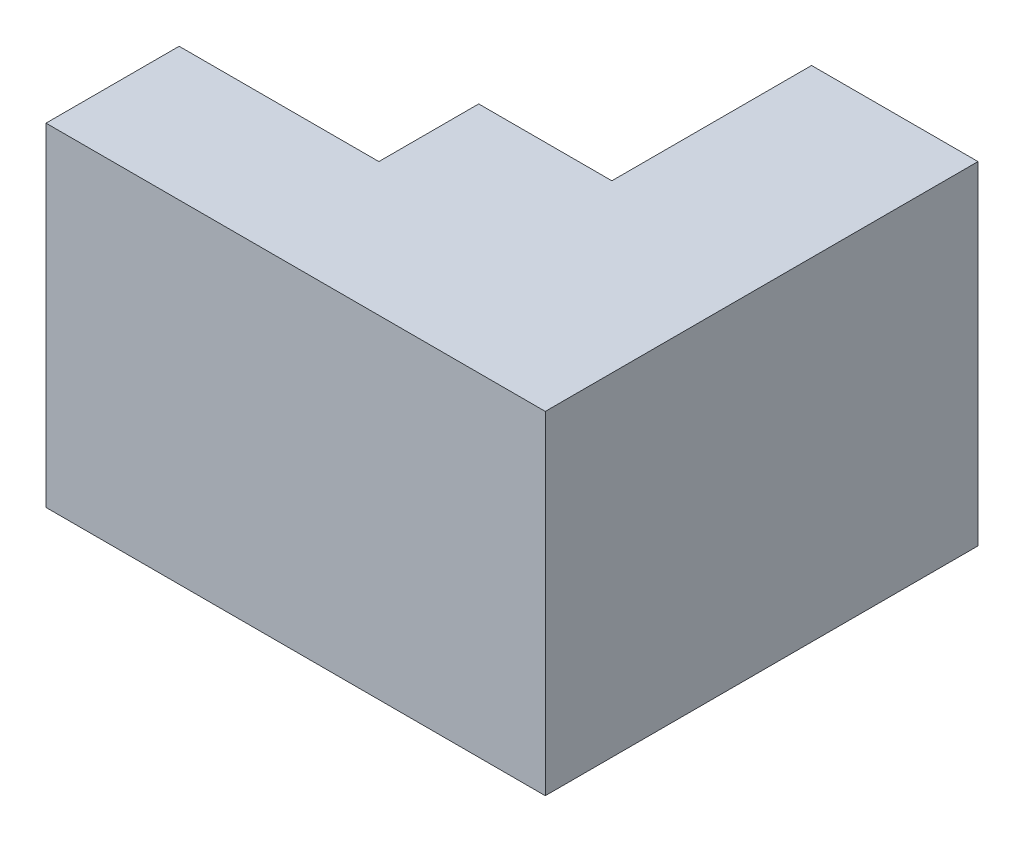
ISO-10303-21;
HEADER;
FILE_DESCRIPTION(('STEP AP214'),'2;1');
FILE_NAME('part.step','',(''),(''),'','','');
FILE_SCHEMA(('AUTOMOTIVE_DESIGN { 1 0 10303 214 1 1 1 1 }'));
ENDSEC;
DATA;
#1=APPLICATION_CONTEXT('core data for automotive mechanical design processes');
#2=APPLICATION_PROTOCOL_DEFINITION('international standard','automotive_design',2000,#1);
#3=PRODUCT_CONTEXT('',#1,'mechanical');
#4=PRODUCT('Part','Part','',(#3));
#5=PRODUCT_RELATED_PRODUCT_CATEGORY('part','',(#4));
#6=PRODUCT_DEFINITION_FORMATION('','',#4);
#7=PRODUCT_DEFINITION_CONTEXT('part definition',#1,'design');
#8=PRODUCT_DEFINITION('design','',#6,#7);
#9=PRODUCT_DEFINITION_SHAPE('','',#8);
#10=(LENGTH_UNIT() NAMED_UNIT(*) SI_UNIT(.MILLI.,.METRE.));
#11=(NAMED_UNIT(*) PLANE_ANGLE_UNIT() SI_UNIT($,.RADIAN.));
#12=(NAMED_UNIT(*) SI_UNIT($,.STERADIAN.) SOLID_ANGLE_UNIT());
#13=UNCERTAINTY_MEASURE_WITH_UNIT(LENGTH_MEASURE(1.E-05),#10,'distance_accuracy_value','');
#14=(GEOMETRIC_REPRESENTATION_CONTEXT(3) GLOBAL_UNCERTAINTY_ASSIGNED_CONTEXT((#13)) GLOBAL_UNIT_ASSIGNED_CONTEXT((#10,
#11,#12)) REPRESENTATION_CONTEXT('',''));
#15=CARTESIAN_POINT('',(0.,0.,0.));
#16=DIRECTION('',(0.,0.,1.));
#17=DIRECTION('',(1.,0.,0.));
#18=AXIS2_PLACEMENT_3D('',#15,#16,#17);
#19=CARTESIAN_POINT('',(0.,50.,-20.));
#20=DIRECTION('',(1.,0.,0.));
#21=DIRECTION('',(0.,0.,-1.));
#22=AXIS2_PLACEMENT_3D('',#19,#20,#21);
#23=PLANE('',#22);
#24=DIRECTION('',(0.,0.,1.));
#25=VECTOR('',#24,1.);
#26=CARTESIAN_POINT('',(0.,0.,-20.));
#27=LINE('',#26,#25);
#28=CARTESIAN_POINT('',(0.,0.,-20.));
#29=VERTEX_POINT('',#28);
#30=CARTESIAN_POINT('',(0.,0.,0.));
#31=VERTEX_POINT('',#30);
#32=EDGE_CURVE('E140',#29,#31,#27,.T.);
#33=ORIENTED_EDGE('',*,*,#32,.T.);
#34=DIRECTION('',(0.,-1.,0.));
#35=VECTOR('',#34,1.);
#36=CARTESIAN_POINT('',(0.,50.,0.));
#37=LINE('',#36,#35);
#38=CARTESIAN_POINT('',(0.,50.,0.));
#39=VERTEX_POINT('',#38);
#40=EDGE_CURVE('E11',#39,#31,#37,.T.);
#41=ORIENTED_EDGE('',*,*,#40,.F.);
#42=DIRECTION('',(0.,0.,1.));
#43=VECTOR('',#42,1.);
#44=CARTESIAN_POINT('',(0.,50.,-20.));
#45=LINE('',#44,#43);
#46=CARTESIAN_POINT('',(0.,50.,-20.));
#47=VERTEX_POINT('',#46);
#48=EDGE_CURVE('E162',#47,#39,#45,.T.);
#49=ORIENTED_EDGE('',*,*,#48,.F.);
#50=DIRECTION('',(0.,-1.,0.));
#51=VECTOR('',#50,1.);
#52=CARTESIAN_POINT('',(0.,50.,-20.));
#53=LINE('',#52,#51);
#54=EDGE_CURVE('E136',#47,#29,#53,.T.);
#55=ORIENTED_EDGE('',*,*,#54,.T.);
#56=EDGE_LOOP('',(#33,#41,#49,#55));
#57=FACE_BOUND('',#56,.T.);
#58=ADVANCED_FACE('F39',(#57),#23,.F.);
#59=CARTESIAN_POINT('',(0.,50.,0.));
#60=DIRECTION('',(0.,0.,-1.));
#61=DIRECTION('',(-1.,0.,0.));
#62=AXIS2_PLACEMENT_3D('',#59,#60,#61);
#63=PLANE('',#62);
#64=DIRECTION('',(1.,0.,0.));
#65=VECTOR('',#64,1.);
#66=CARTESIAN_POINT('',(0.,0.,0.));
#67=LINE('',#66,#65);
#68=CARTESIAN_POINT('',(75.,0.,0.));
#69=VERTEX_POINT('',#68);
#70=EDGE_CURVE('E144',#31,#69,#67,.T.);
#71=ORIENTED_EDGE('',*,*,#70,.T.);
#72=DIRECTION('',(0.,-1.,0.));
#73=VECTOR('',#72,1.);
#74=CARTESIAN_POINT('',(75.,50.,0.));
#75=LINE('',#74,#73);
#76=CARTESIAN_POINT('',(75.,50.,0.));
#77=VERTEX_POINT('',#76);
#78=EDGE_CURVE('E48',#77,#69,#75,.T.);
#79=ORIENTED_EDGE('',*,*,#78,.F.);
#80=DIRECTION('',(1.,0.,0.));
#81=VECTOR('',#80,1.);
#82=CARTESIAN_POINT('',(0.,50.,0.));
#83=LINE('',#82,#81);
#84=EDGE_CURVE('E99',#39,#77,#83,.T.);
#85=ORIENTED_EDGE('',*,*,#84,.F.);
#86=ORIENTED_EDGE('',*,*,#40,.T.);
#87=EDGE_LOOP('',(#71,#79,#85,#86));
#88=FACE_BOUND('',#87,.T.);
#89=ADVANCED_FACE('F208',(#88),#63,.F.);
#90=CARTESIAN_POINT('',(75.,50.,0.));
#91=DIRECTION('',(-1.,0.,0.));
#92=DIRECTION('',(0.,0.,1.));
#93=AXIS2_PLACEMENT_3D('',#90,#91,#92);
#94=PLANE('',#93);
#95=DIRECTION('',(0.,0.,-1.));
#96=VECTOR('',#95,1.);
#97=CARTESIAN_POINT('',(75.,0.,0.));
#98=LINE('',#97,#96);
#99=CARTESIAN_POINT('',(75.,0.,-65.));
#100=VERTEX_POINT('',#99);
#101=EDGE_CURVE('E147',#69,#100,#98,.T.);
#102=ORIENTED_EDGE('',*,*,#101,.T.);
#103=DIRECTION('',(0.,-1.,0.));
#104=VECTOR('',#103,1.);
#105=CARTESIAN_POINT('',(75.,50.,-65.));
#106=LINE('',#105,#104);
#107=CARTESIAN_POINT('',(75.,50.,-65.));
#108=VERTEX_POINT('',#107);
#109=EDGE_CURVE('E173',#108,#100,#106,.T.);
#110=ORIENTED_EDGE('',*,*,#109,.F.);
#111=DIRECTION('',(0.,0.,-1.));
#112=VECTOR('',#111,1.);
#113=CARTESIAN_POINT('',(75.,50.,0.));
#114=LINE('',#113,#112);
#115=EDGE_CURVE('E183',#77,#108,#114,.T.);
#116=ORIENTED_EDGE('',*,*,#115,.F.);
#117=ORIENTED_EDGE('',*,*,#78,.T.);
#118=EDGE_LOOP('',(#102,#110,#116,#117));
#119=FACE_BOUND('',#118,.T.);
#120=ADVANCED_FACE('F181',(#119),#94,.F.);
#121=CARTESIAN_POINT('',(75.,50.,-65.));
#122=DIRECTION('',(0.,0.,1.));
#123=DIRECTION('',(1.,0.,0.));
#124=AXIS2_PLACEMENT_3D('',#121,#122,#123);
#125=PLANE('',#124);
#126=DIRECTION('',(-1.,0.,0.));
#127=VECTOR('',#126,1.);
#128=CARTESIAN_POINT('',(75.,0.,-65.));
#129=LINE('',#128,#127);
#130=CARTESIAN_POINT('',(50.,0.,-65.));
#131=VERTEX_POINT('',#130);
#132=EDGE_CURVE('E150',#100,#131,#129,.T.);
#133=ORIENTED_EDGE('',*,*,#132,.T.);
#134=DIRECTION('',(0.,-1.,0.));
#135=VECTOR('',#134,1.);
#136=CARTESIAN_POINT('',(50.,50.,-65.));
#137=LINE('',#136,#135);
#138=CARTESIAN_POINT('',(50.,50.,-65.));
#139=VERTEX_POINT('',#138);
#140=EDGE_CURVE('E169',#139,#131,#137,.T.);
#141=ORIENTED_EDGE('',*,*,#140,.F.);
#142=DIRECTION('',(-1.,0.,0.));
#143=VECTOR('',#142,1.);
#144=CARTESIAN_POINT('',(75.,50.,-65.));
#145=LINE('',#144,#143);
#146=EDGE_CURVE('E196',#108,#139,#145,.T.);
#147=ORIENTED_EDGE('',*,*,#146,.F.);
#148=ORIENTED_EDGE('',*,*,#109,.T.);
#149=EDGE_LOOP('',(#133,#141,#147,#148));
#150=FACE_BOUND('',#149,.T.);
#151=ADVANCED_FACE('F191',(#150),#125,.F.);
#152=CARTESIAN_POINT('',(50.,50.,-65.));
#153=DIRECTION('',(1.,0.,0.));
#154=DIRECTION('',(0.,0.,-1.));
#155=AXIS2_PLACEMENT_3D('',#152,#153,#154);
#156=PLANE('',#155);
#157=DIRECTION('',(0.,0.,1.));
#158=VECTOR('',#157,1.);
#159=CARTESIAN_POINT('',(50.,0.,-65.));
#160=LINE('',#159,#158);
#161=CARTESIAN_POINT('',(50.,0.,-35.));
#162=VERTEX_POINT('',#161);
#163=EDGE_CURVE('E153',#131,#162,#160,.T.);
#164=ORIENTED_EDGE('',*,*,#163,.T.);
#165=DIRECTION('',(0.,-1.,0.));
#166=VECTOR('',#165,1.);
#167=CARTESIAN_POINT('',(50.,50.,-35.));
#168=LINE('',#167,#166);
#169=CARTESIAN_POINT('',(50.,50.,-35.));
#170=VERTEX_POINT('',#169);
#171=EDGE_CURVE('E129',#170,#162,#168,.T.);
#172=ORIENTED_EDGE('',*,*,#171,.F.);
#173=DIRECTION('',(0.,0.,1.));
#174=VECTOR('',#173,1.);
#175=CARTESIAN_POINT('',(50.,50.,-65.));
#176=LINE('',#175,#174);
#177=EDGE_CURVE('E118',#139,#170,#176,.T.);
#178=ORIENTED_EDGE('',*,*,#177,.F.);
#179=ORIENTED_EDGE('',*,*,#140,.T.);
#180=EDGE_LOOP('',(#164,#172,#178,#179));
#181=FACE_BOUND('',#180,.T.);
#182=ADVANCED_FACE('F194',(#181),#156,.F.);
#183=CARTESIAN_POINT('',(50.,50.,-35.));
#184=DIRECTION('',(0.,0.,1.));
#185=DIRECTION('',(1.,0.,0.));
#186=AXIS2_PLACEMENT_3D('',#183,#184,#185);
#187=PLANE('',#186);
#188=DIRECTION('',(-1.,0.,0.));
#189=VECTOR('',#188,1.);
#190=CARTESIAN_POINT('',(50.,0.,-35.));
#191=LINE('',#190,#189);
#192=CARTESIAN_POINT('',(30.,0.,-35.));
#193=VERTEX_POINT('',#192);
#194=EDGE_CURVE('E127',#162,#193,#191,.T.);
#195=ORIENTED_EDGE('',*,*,#194,.T.);
#196=DIRECTION('',(0.,-1.,0.));
#197=VECTOR('',#196,1.);
#198=CARTESIAN_POINT('',(30.,50.,-35.));
#199=LINE('',#198,#197);
#200=CARTESIAN_POINT('',(30.,50.,-35.));
#201=VERTEX_POINT('',#200);
#202=EDGE_CURVE('E124',#201,#193,#199,.T.);
#203=ORIENTED_EDGE('',*,*,#202,.F.);
#204=DIRECTION('',(-1.,0.,0.));
#205=VECTOR('',#204,1.);
#206=CARTESIAN_POINT('',(50.,50.,-35.));
#207=LINE('',#206,#205);
#208=EDGE_CURVE('E112',#170,#201,#207,.T.);
#209=ORIENTED_EDGE('',*,*,#208,.F.);
#210=ORIENTED_EDGE('',*,*,#171,.T.);
#211=EDGE_LOOP('',(#195,#203,#209,#210));
#212=FACE_BOUND('',#211,.T.);
#213=ADVANCED_FACE('F125',(#212),#187,.F.);
#214=CARTESIAN_POINT('',(30.,50.,-35.));
#215=DIRECTION('',(1.,0.,0.));
#216=DIRECTION('',(0.,0.,-1.));
#217=AXIS2_PLACEMENT_3D('',#214,#215,#216);
#218=PLANE('',#217);
#219=DIRECTION('',(0.,0.,1.));
#220=VECTOR('',#219,1.);
#221=CARTESIAN_POINT('',(30.,0.,-35.));
#222=LINE('',#221,#220);
#223=CARTESIAN_POINT('',(30.,0.,-20.));
#224=VERTEX_POINT('',#223);
#225=EDGE_CURVE('E85',#193,#224,#222,.T.);
#226=ORIENTED_EDGE('',*,*,#225,.T.);
#227=DIRECTION('',(0.,-1.,0.));
#228=VECTOR('',#227,1.);
#229=CARTESIAN_POINT('',(30.,50.,-20.));
#230=LINE('',#229,#228);
#231=CARTESIAN_POINT('',(30.,50.,-20.));
#232=VERTEX_POINT('',#231);
#233=EDGE_CURVE('E130',#232,#224,#230,.T.);
#234=ORIENTED_EDGE('',*,*,#233,.F.);
#235=DIRECTION('',(0.,0.,1.));
#236=VECTOR('',#235,1.);
#237=CARTESIAN_POINT('',(30.,50.,-35.));
#238=LINE('',#237,#236);
#239=EDGE_CURVE('E116',#201,#232,#238,.T.);
#240=ORIENTED_EDGE('',*,*,#239,.F.);
#241=ORIENTED_EDGE('',*,*,#202,.T.);
#242=EDGE_LOOP('',(#226,#234,#240,#241));
#243=FACE_BOUND('',#242,.T.);
#244=ADVANCED_FACE('F132',(#243),#218,.F.);
#245=CARTESIAN_POINT('',(30.,50.,-20.));
#246=DIRECTION('',(0.,0.,1.));
#247=DIRECTION('',(1.,0.,0.));
#248=AXIS2_PLACEMENT_3D('',#245,#246,#247);
#249=PLANE('',#248);
#250=DIRECTION('',(-1.,0.,0.));
#251=VECTOR('',#250,1.);
#252=CARTESIAN_POINT('',(30.,0.,-20.));
#253=LINE('',#252,#251);
#254=EDGE_CURVE('E91',#224,#29,#253,.T.);
#255=ORIENTED_EDGE('',*,*,#254,.T.);
#256=ORIENTED_EDGE('',*,*,#54,.F.);
#257=DIRECTION('',(-1.,0.,0.));
#258=VECTOR('',#257,1.);
#259=CARTESIAN_POINT('',(30.,50.,-20.));
#260=LINE('',#259,#258);
#261=EDGE_CURVE('E56',#232,#47,#260,.T.);
#262=ORIENTED_EDGE('',*,*,#261,.F.);
#263=ORIENTED_EDGE('',*,*,#233,.T.);
#264=EDGE_LOOP('',(#255,#256,#262,#263));
#265=FACE_BOUND('',#264,.T.);
#266=ADVANCED_FACE('F224',(#265),#249,.F.);
#267=CARTESIAN_POINT('',(0.,50.,0.));
#268=DIRECTION('',(0.,1.,0.));
#269=DIRECTION('',(0.,0.,1.));
#270=AXIS2_PLACEMENT_3D('',#267,#268,#269);
#271=PLANE('',#270);
#272=ORIENTED_EDGE('',*,*,#48,.T.);
#273=ORIENTED_EDGE('',*,*,#84,.T.);
#274=ORIENTED_EDGE('',*,*,#115,.T.);
#275=ORIENTED_EDGE('',*,*,#146,.T.);
#276=ORIENTED_EDGE('',*,*,#177,.T.);
#277=ORIENTED_EDGE('',*,*,#208,.T.);
#278=ORIENTED_EDGE('',*,*,#239,.T.);
#279=ORIENTED_EDGE('',*,*,#261,.T.);
#280=EDGE_LOOP('',(#272,#273,#274,#275,#276,#277,#278,#279));
#281=FACE_BOUND('',#280,.T.);
#282=ADVANCED_FACE('F114',(#281),#271,.T.);
#283=CARTESIAN_POINT('',(0.,0.,0.));
#284=DIRECTION('',(0.,1.,0.));
#285=DIRECTION('',(0.,0.,1.));
#286=AXIS2_PLACEMENT_3D('',#283,#284,#285);
#287=PLANE('',#286);
#288=ORIENTED_EDGE('',*,*,#32,.F.);
#289=ORIENTED_EDGE('',*,*,#254,.F.);
#290=ORIENTED_EDGE('',*,*,#225,.F.);
#291=ORIENTED_EDGE('',*,*,#194,.F.);
#292=ORIENTED_EDGE('',*,*,#163,.F.);
#293=ORIENTED_EDGE('',*,*,#132,.F.);
#294=ORIENTED_EDGE('',*,*,#101,.F.);
#295=ORIENTED_EDGE('',*,*,#70,.F.);
#296=EDGE_LOOP('',(#288,#289,#290,#291,#292,#293,#294,#295));
#297=FACE_BOUND('',#296,.T.);
#298=ADVANCED_FACE('F187',(#297),#287,.F.);
#299=CLOSED_SHELL('',(#58,#89,#120,#151,#182,#213,#244,#266,#282,#298));
#300=MANIFOLD_SOLID_BREP('B2',#299);
#301=ADVANCED_BREP_SHAPE_REPRESENTATION('',(#18,#300),#14);
#302=SHAPE_DEFINITION_REPRESENTATION(#9,#301);
ENDSEC;
END-ISO-10303-21;
